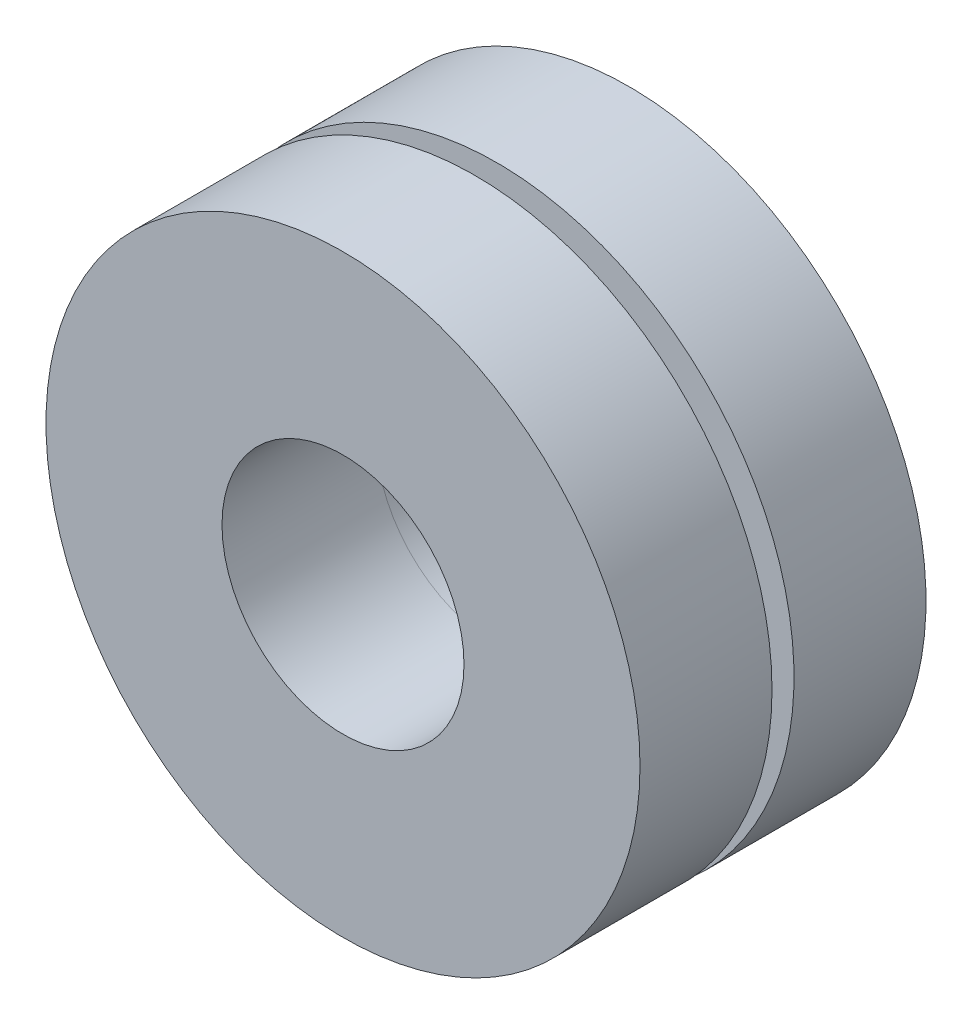
ISO-10303-21;
HEADER;
FILE_DESCRIPTION(('STEP AP214'),'2;1');
FILE_NAME('part.step','',(''),(''),'','','');
FILE_SCHEMA(('AUTOMOTIVE_DESIGN { 1 0 10303 214 1 1 1 1 }'));
ENDSEC;
DATA;
#1=APPLICATION_CONTEXT('core data for automotive mechanical design processes');
#2=APPLICATION_PROTOCOL_DEFINITION('international standard','automotive_design',2000,#1);
#3=PRODUCT_CONTEXT('',#1,'mechanical');
#4=PRODUCT('Part','Part','',(#3));
#5=PRODUCT_RELATED_PRODUCT_CATEGORY('part','',(#4));
#6=PRODUCT_DEFINITION_FORMATION('','',#4);
#7=PRODUCT_DEFINITION_CONTEXT('part definition',#1,'design');
#8=PRODUCT_DEFINITION('design','',#6,#7);
#9=PRODUCT_DEFINITION_SHAPE('','',#8);
#10=(LENGTH_UNIT() NAMED_UNIT(*) SI_UNIT(.MILLI.,.METRE.));
#11=(NAMED_UNIT(*) PLANE_ANGLE_UNIT() SI_UNIT($,.RADIAN.));
#12=(NAMED_UNIT(*) SI_UNIT($,.STERADIAN.) SOLID_ANGLE_UNIT());
#13=UNCERTAINTY_MEASURE_WITH_UNIT(LENGTH_MEASURE(1.E-05),#10,'distance_accuracy_value','');
#14=(GEOMETRIC_REPRESENTATION_CONTEXT(3) GLOBAL_UNCERTAINTY_ASSIGNED_CONTEXT((#13)) GLOBAL_UNIT_ASSIGNED_CONTEXT((#10,
#11,#12)) REPRESENTATION_CONTEXT('',''));
#15=CARTESIAN_POINT('',(0.,0.,0.));
#16=DIRECTION('',(0.,0.,1.));
#17=DIRECTION('',(1.,0.,0.));
#18=AXIS2_PLACEMENT_3D('',#15,#16,#17);
#19=CARTESIAN_POINT('',(0.,0.,-3.048));
#20=DIRECTION('',(0.,0.,-1.));
#21=DIRECTION('',(-1.,0.,0.));
#22=AXIS2_PLACEMENT_3D('',#19,#20,#21);
#23=PLANE('',#22);
#24=CARTESIAN_POINT('',(0.,0.,-3.048));
#25=DIRECTION('',(0.,0.,-1.));
#26=DIRECTION('',(-1.,0.,0.));
#27=AXIS2_PLACEMENT_3D('',#24,#25,#26);
#28=CIRCLE('',#27,6.858);
#29=CARTESIAN_POINT('',(-6.858,0.,-3.048));
#30=VERTEX_POINT('',#29);
#31=EDGE_CURVE('E11',#30,#30,#28,.T.);
#32=ORIENTED_EDGE('',*,*,#31,.T.);
#33=EDGE_LOOP('',(#32));
#34=FACE_BOUND('',#33,.T.);
#35=CARTESIAN_POINT('',(0.,0.,-3.048));
#36=DIRECTION('',(0.,0.,-1.));
#37=DIRECTION('',(-1.,0.,0.));
#38=AXIS2_PLACEMENT_3D('',#35,#36,#37);
#39=CIRCLE('',#38,2.794);
#40=CARTESIAN_POINT('',(-2.794,0.,-3.048));
#41=VERTEX_POINT('',#40);
#42=EDGE_CURVE('E50',#41,#41,#39,.T.);
#43=ORIENTED_EDGE('',*,*,#42,.F.);
#44=EDGE_LOOP('',(#43));
#45=FACE_BOUND('',#44,.T.);
#46=ADVANCED_FACE('F39',(#34,#45),#23,.T.);
#47=CARTESIAN_POINT('',(0.,0.,0.));
#48=DIRECTION('',(0.,0.,-1.));
#49=DIRECTION('',(-1.,0.,0.));
#50=AXIS2_PLACEMENT_3D('',#47,#48,#49);
#51=PLANE('',#50);
#52=CARTESIAN_POINT('',(0.,0.,0.));
#53=DIRECTION('',(0.,0.,-1.));
#54=DIRECTION('',(-1.,0.,0.));
#55=AXIS2_PLACEMENT_3D('',#52,#53,#54);
#56=CIRCLE('',#55,6.858);
#57=CARTESIAN_POINT('',(-6.858,0.,0.));
#58=VERTEX_POINT('',#57);
#59=EDGE_CURVE('E43',#58,#58,#56,.T.);
#60=ORIENTED_EDGE('',*,*,#59,.F.);
#61=EDGE_LOOP('',(#60));
#62=FACE_BOUND('',#61,.T.);
#63=CARTESIAN_POINT('',(0.,0.,0.));
#64=DIRECTION('',(0.,0.,-1.));
#65=DIRECTION('',(-1.,0.,0.));
#66=AXIS2_PLACEMENT_3D('',#63,#64,#65);
#67=CIRCLE('',#66,2.794);
#68=CARTESIAN_POINT('',(-2.794,0.,0.));
#69=VERTEX_POINT('',#68);
#70=EDGE_CURVE('E52',#69,#69,#67,.T.);
#71=ORIENTED_EDGE('',*,*,#70,.T.);
#72=EDGE_LOOP('',(#71));
#73=FACE_BOUND('',#72,.T.);
#74=ADVANCED_FACE('F62',(#62,#73),#51,.F.);
#75=CARTESIAN_POINT('',(0.,0.,-3.048));
#76=DIRECTION('',(0.,0.,1.));
#77=DIRECTION('',(1.,0.,0.));
#78=AXIS2_PLACEMENT_3D('',#75,#76,#77);
#79=CYLINDRICAL_SURFACE('',#78,6.858);
#80=ORIENTED_EDGE('',*,*,#31,.F.);
#81=EDGE_LOOP('',(#80));
#82=FACE_BOUND('',#81,.T.);
#83=ORIENTED_EDGE('',*,*,#59,.T.);
#84=EDGE_LOOP('',(#83));
#85=FACE_BOUND('',#84,.T.);
#86=ADVANCED_FACE('F41',(#82,#85),#79,.T.);
#87=CARTESIAN_POINT('',(0.,0.,-3.048));
#88=DIRECTION('',(0.,0.,1.));
#89=DIRECTION('',(1.,0.,0.));
#90=AXIS2_PLACEMENT_3D('',#87,#88,#89);
#91=CYLINDRICAL_SURFACE('',#90,2.794);
#92=ORIENTED_EDGE('',*,*,#42,.T.);
#93=EDGE_LOOP('',(#92));
#94=FACE_BOUND('',#93,.T.);
#95=ORIENTED_EDGE('',*,*,#70,.F.);
#96=EDGE_LOOP('',(#95));
#97=FACE_BOUND('',#96,.T.);
#98=ADVANCED_FACE('F58',(#94,#97),#91,.F.);
#99=CLOSED_SHELL('',(#46,#74,#86,#98));
#100=MANIFOLD_SOLID_BREP('B2',#99);
#101=CARTESIAN_POINT('',(0.,0.,0.));
#102=DIRECTION('',(0.,0.,1.));
#103=DIRECTION('',(1.,0.,0.));
#104=AXIS2_PLACEMENT_3D('',#101,#102,#103);
#105=PLANE('',#104);
#106=CARTESIAN_POINT('',(0.,0.,0.));
#107=DIRECTION('',(0.,0.,1.));
#108=DIRECTION('',(1.,0.,0.));
#109=AXIS2_PLACEMENT_3D('',#106,#107,#108);
#110=CIRCLE('',#109,6.096);
#111=CARTESIAN_POINT('',(6.096,0.,0.));
#112=VERTEX_POINT('',#111);
#113=EDGE_CURVE('E105',#112,#112,#110,.T.);
#114=ORIENTED_EDGE('',*,*,#113,.F.);
#115=EDGE_LOOP('',(#114));
#116=FACE_BOUND('',#115,.T.);
#117=CARTESIAN_POINT('',(0.,0.,0.));
#118=DIRECTION('',(0.,0.,1.));
#119=DIRECTION('',(1.,0.,0.));
#120=AXIS2_PLACEMENT_3D('',#117,#118,#119);
#121=CIRCLE('',#120,2.794);
#122=CARTESIAN_POINT('',(2.794,0.,0.));
#123=VERTEX_POINT('',#122);
#124=EDGE_CURVE('E112',#123,#123,#121,.T.);
#125=ORIENTED_EDGE('',*,*,#124,.T.);
#126=EDGE_LOOP('',(#125));
#127=FACE_BOUND('',#126,.T.);
#128=ADVANCED_FACE('F101',(#116,#127),#105,.F.);
#129=CARTESIAN_POINT('',(0.,0.,0.508));
#130=DIRECTION('',(0.,0.,-1.));
#131=DIRECTION('',(-1.,0.,0.));
#132=AXIS2_PLACEMENT_3D('',#129,#130,#131);
#133=CYLINDRICAL_SURFACE('',#132,6.096);
#134=CARTESIAN_POINT('',(0.,0.,0.508));
#135=DIRECTION('',(0.,0.,1.));
#136=DIRECTION('',(1.,0.,0.));
#137=AXIS2_PLACEMENT_3D('',#134,#135,#136);
#138=CIRCLE('',#137,6.096);
#139=CARTESIAN_POINT('',(6.096,0.,0.508));
#140=VERTEX_POINT('',#139);
#141=EDGE_CURVE('E38',#140,#140,#138,.T.);
#142=ORIENTED_EDGE('',*,*,#141,.F.);
#143=EDGE_LOOP('',(#142));
#144=FACE_BOUND('',#143,.T.);
#145=ORIENTED_EDGE('',*,*,#113,.T.);
#146=EDGE_LOOP('',(#145));
#147=FACE_BOUND('',#146,.T.);
#148=ADVANCED_FACE('F103',(#144,#147),#133,.T.);
#149=CARTESIAN_POINT('',(0.,0.,0.508));
#150=DIRECTION('',(0.,0.,-1.));
#151=DIRECTION('',(-1.,0.,0.));
#152=AXIS2_PLACEMENT_3D('',#149,#150,#151);
#153=CYLINDRICAL_SURFACE('',#152,2.794);
#154=ORIENTED_EDGE('',*,*,#124,.F.);
#155=EDGE_LOOP('',(#154));
#156=FACE_BOUND('',#155,.T.);
#157=CARTESIAN_POINT('',(0.,0.,3.556));
#158=DIRECTION('',(0.,0.,1.));
#159=DIRECTION('',(1.,0.,0.));
#160=AXIS2_PLACEMENT_3D('',#157,#158,#159);
#161=CIRCLE('',#160,2.794);
#162=CARTESIAN_POINT('',(2.794,0.,3.556));
#163=VERTEX_POINT('',#162);
#164=EDGE_CURVE('E120',#163,#163,#161,.T.);
#165=ORIENTED_EDGE('',*,*,#164,.T.);
#166=EDGE_LOOP('',(#165));
#167=FACE_BOUND('',#166,.T.);
#168=ADVANCED_FACE('F126',(#156,#167),#153,.F.);
#169=CARTESIAN_POINT('',(0.,0.,0.508));
#170=DIRECTION('',(0.,0.,1.));
#171=DIRECTION('',(1.,0.,0.));
#172=AXIS2_PLACEMENT_3D('',#169,#170,#171);
#173=PLANE('',#172);
#174=CARTESIAN_POINT('',(0.,0.,0.508));
#175=DIRECTION('',(0.,0.,1.));
#176=DIRECTION('',(1.,0.,0.));
#177=AXIS2_PLACEMENT_3D('',#174,#175,#176);
#178=CIRCLE('',#177,6.858);
#179=CARTESIAN_POINT('',(6.858,0.,0.508));
#180=VERTEX_POINT('',#179);
#181=EDGE_CURVE('E117',#180,#180,#178,.T.);
#182=ORIENTED_EDGE('',*,*,#181,.F.);
#183=EDGE_LOOP('',(#182));
#184=FACE_BOUND('',#183,.T.);
#185=ORIENTED_EDGE('',*,*,#141,.T.);
#186=EDGE_LOOP('',(#185));
#187=FACE_BOUND('',#186,.T.);
#188=ADVANCED_FACE('F131',(#184,#187),#173,.F.);
#189=CARTESIAN_POINT('',(0.,0.,3.556));
#190=DIRECTION('',(0.,0.,1.));
#191=DIRECTION('',(1.,0.,0.));
#192=AXIS2_PLACEMENT_3D('',#189,#190,#191);
#193=PLANE('',#192);
#194=CARTESIAN_POINT('',(0.,0.,3.556));
#195=DIRECTION('',(0.,0.,1.));
#196=DIRECTION('',(1.,0.,0.));
#197=AXIS2_PLACEMENT_3D('',#194,#195,#196);
#198=CIRCLE('',#197,6.858);
#199=CARTESIAN_POINT('',(6.858,0.,3.556));
#200=VERTEX_POINT('',#199);
#201=EDGE_CURVE('E116',#200,#200,#198,.T.);
#202=ORIENTED_EDGE('',*,*,#201,.T.);
#203=EDGE_LOOP('',(#202));
#204=FACE_BOUND('',#203,.T.);
#205=ORIENTED_EDGE('',*,*,#164,.F.);
#206=EDGE_LOOP('',(#205));
#207=FACE_BOUND('',#206,.T.);
#208=ADVANCED_FACE('F128',(#204,#207),#193,.T.);
#209=CARTESIAN_POINT('',(0.,0.,3.556));
#210=DIRECTION('',(0.,0.,-1.));
#211=DIRECTION('',(-1.,0.,0.));
#212=AXIS2_PLACEMENT_3D('',#209,#210,#211);
#213=CYLINDRICAL_SURFACE('',#212,6.858);
#214=ORIENTED_EDGE('',*,*,#201,.F.);
#215=EDGE_LOOP('',(#214));
#216=FACE_BOUND('',#215,.T.);
#217=ORIENTED_EDGE('',*,*,#181,.T.);
#218=EDGE_LOOP('',(#217));
#219=FACE_BOUND('',#218,.T.);
#220=ADVANCED_FACE('F130',(#216,#219),#213,.T.);
#221=CLOSED_SHELL('',(#128,#148,#168,#188,#208,#220));
#222=MANIFOLD_SOLID_BREP('B6',#221);
#223=ADVANCED_BREP_SHAPE_REPRESENTATION('',(#18,#100,#222),#14);
#224=SHAPE_DEFINITION_REPRESENTATION(#9,#223);
ENDSEC;
END-ISO-10303-21;
